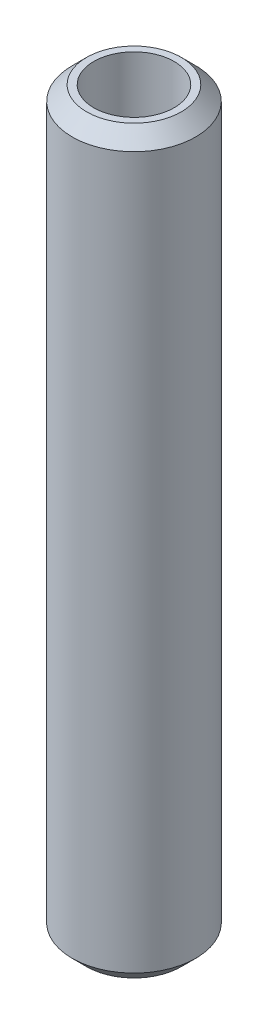
ISO-10303-21;
HEADER;
FILE_DESCRIPTION(('STEP AP214'),'2;1');
FILE_NAME('part.step','',(''),(''),'','','');
FILE_SCHEMA(('AUTOMOTIVE_DESIGN { 1 0 10303 214 1 1 1 1 }'));
ENDSEC;
DATA;
#1=APPLICATION_CONTEXT('core data for automotive mechanical design processes');
#2=APPLICATION_PROTOCOL_DEFINITION('international standard','automotive_design',2000,#1);
#3=PRODUCT_CONTEXT('',#1,'mechanical');
#4=PRODUCT('Part','Part','',(#3));
#5=PRODUCT_RELATED_PRODUCT_CATEGORY('part','',(#4));
#6=PRODUCT_DEFINITION_FORMATION('','',#4);
#7=PRODUCT_DEFINITION_CONTEXT('part definition',#1,'design');
#8=PRODUCT_DEFINITION('design','',#6,#7);
#9=PRODUCT_DEFINITION_SHAPE('','',#8);
#10=(LENGTH_UNIT() NAMED_UNIT(*) SI_UNIT(.MILLI.,.METRE.));
#11=(NAMED_UNIT(*) PLANE_ANGLE_UNIT() SI_UNIT($,.RADIAN.));
#12=(NAMED_UNIT(*) SI_UNIT($,.STERADIAN.) SOLID_ANGLE_UNIT());
#13=UNCERTAINTY_MEASURE_WITH_UNIT(LENGTH_MEASURE(1.E-05),#10,'distance_accuracy_value','');
#14=(GEOMETRIC_REPRESENTATION_CONTEXT(3) GLOBAL_UNCERTAINTY_ASSIGNED_CONTEXT((#13)) GLOBAL_UNIT_ASSIGNED_CONTEXT((#10,
#11,#12)) REPRESENTATION_CONTEXT('',''));
#15=CARTESIAN_POINT('',(0.,0.,0.));
#16=DIRECTION('',(0.,0.,1.));
#17=DIRECTION('',(1.,0.,0.));
#18=AXIS2_PLACEMENT_3D('',#15,#16,#17);
#19=CARTESIAN_POINT('',(0.,89.905274097633,0.));
#20=DIRECTION('',(0.,-1.,0.));
#21=DIRECTION('',(0.,0.,-1.));
#22=AXIS2_PLACEMENT_3D('',#19,#20,#21);
#23=CYLINDRICAL_SURFACE('',#22,7.5);
#24=CARTESIAN_POINT('',(0.,88.1478797142644,0.));
#25=DIRECTION('',(0.,1.,0.));
#26=DIRECTION('',(0.,0.,1.));
#27=AXIS2_PLACEMENT_3D('',#24,#25,#26);
#28=CIRCLE('',#27,7.5);
#29=CARTESIAN_POINT('',(0.,88.1478797142644,7.5));
#30=VERTEX_POINT('',#29);
#31=EDGE_CURVE('E50',#30,#30,#28,.F.);
#32=ORIENTED_EDGE('',*,*,#31,.T.);
#33=EDGE_LOOP('',(#32));
#34=FACE_BOUND('',#33,.T.);
#35=CARTESIAN_POINT('',(0.,1.75739438336855,0.));
#36=DIRECTION('',(0.,1.,0.));
#37=DIRECTION('',(0.,0.,1.));
#38=AXIS2_PLACEMENT_3D('',#35,#36,#37);
#39=CIRCLE('',#38,7.5);
#40=CARTESIAN_POINT('',(0.,1.75739438336855,7.5));
#41=VERTEX_POINT('',#40);
#42=EDGE_CURVE('E51',#41,#41,#39,.T.);
#43=ORIENTED_EDGE('',*,*,#42,.T.);
#44=EDGE_LOOP('',(#43));
#45=FACE_BOUND('',#44,.T.);
#46=ADVANCED_FACE('F39',(#34,#45),#23,.T.);
#47=CARTESIAN_POINT('',(0.,89.905274097633,0.));
#48=DIRECTION('',(0.,1.,0.));
#49=DIRECTION('',(0.,0.,1.));
#50=AXIS2_PLACEMENT_3D('',#47,#48,#49);
#51=PLANE('',#50);
#52=CARTESIAN_POINT('',(0.,89.905274097633,0.));
#53=DIRECTION('',(0.,1.,0.));
#54=DIRECTION('',(0.,0.,1.));
#55=AXIS2_PLACEMENT_3D('',#52,#53,#54);
#56=CIRCLE('',#55,5.74260561663147);
#57=CARTESIAN_POINT('',(0.,89.905274097633,5.74260561663147));
#58=VERTEX_POINT('',#57);
#59=EDGE_CURVE('E54',#58,#58,#56,.T.);
#60=ORIENTED_EDGE('',*,*,#59,.T.);
#61=EDGE_LOOP('',(#60));
#62=FACE_BOUND('',#61,.T.);
#63=CARTESIAN_POINT('',(0.,89.905274097633,0.));
#64=DIRECTION('',(0.,1.,0.));
#65=DIRECTION('',(0.,0.,1.));
#66=AXIS2_PLACEMENT_3D('',#63,#64,#65);
#67=CIRCLE('',#66,4.87910478652996);
#68=CARTESIAN_POINT('',(0.,89.905274097633,4.87910478652996));
#69=VERTEX_POINT('',#68);
#70=EDGE_CURVE('E58',#69,#69,#67,.T.);
#71=ORIENTED_EDGE('',*,*,#70,.F.);
#72=EDGE_LOOP('',(#71));
#73=FACE_BOUND('',#72,.T.);
#74=ADVANCED_FACE('F69',(#62,#73),#51,.T.);
#75=CARTESIAN_POINT('',(0.,0.,0.));
#76=DIRECTION('',(0.,1.,0.));
#77=DIRECTION('',(0.,0.,1.));
#78=AXIS2_PLACEMENT_3D('',#75,#76,#77);
#79=PLANE('',#78);
#80=CARTESIAN_POINT('',(0.,0.,0.));
#81=DIRECTION('',(0.,1.,0.));
#82=DIRECTION('',(0.,0.,1.));
#83=AXIS2_PLACEMENT_3D('',#80,#81,#82);
#84=CIRCLE('',#83,5.74260561663144);
#85=CARTESIAN_POINT('',(0.,0.,5.74260561663144));
#86=VERTEX_POINT('',#85);
#87=EDGE_CURVE('E10',#86,#86,#84,.F.);
#88=ORIENTED_EDGE('',*,*,#87,.T.);
#89=EDGE_LOOP('',(#88));
#90=FACE_BOUND('',#89,.T.);
#91=CARTESIAN_POINT('',(0.,0.,0.));
#92=DIRECTION('',(0.,1.,0.));
#93=DIRECTION('',(0.,0.,1.));
#94=AXIS2_PLACEMENT_3D('',#91,#92,#93);
#95=CIRCLE('',#94,4.87910478652996);
#96=CARTESIAN_POINT('',(0.,0.,4.87910478652996));
#97=VERTEX_POINT('',#96);
#98=EDGE_CURVE('E63',#97,#97,#95,.T.);
#99=ORIENTED_EDGE('',*,*,#98,.T.);
#100=EDGE_LOOP('',(#99));
#101=FACE_BOUND('',#100,.T.);
#102=ADVANCED_FACE('F75',(#90,#101),#79,.F.);
#103=CARTESIAN_POINT('',(0.,89.905274097633,0.));
#104=DIRECTION('',(0.,-1.,0.));
#105=DIRECTION('',(0.,0.,-1.));
#106=AXIS2_PLACEMENT_3D('',#103,#104,#105);
#107=CYLINDRICAL_SURFACE('',#106,4.87910478652996);
#108=ORIENTED_EDGE('',*,*,#70,.T.);
#109=EDGE_LOOP('',(#108));
#110=FACE_BOUND('',#109,.T.);
#111=ORIENTED_EDGE('',*,*,#98,.F.);
#112=EDGE_LOOP('',(#111));
#113=FACE_BOUND('',#112,.T.);
#114=ADVANCED_FACE('F70',(#110,#113),#107,.F.);
#115=CARTESIAN_POINT('',(0.,89.905274097633,0.));
#116=DIRECTION('',(0.,-1.,0.));
#117=DIRECTION('',(0.,0.,-1.));
#118=AXIS2_PLACEMENT_3D('',#115,#116,#117);
#119=CONICAL_SURFACE('',#118,5.74260561663147,0.785398163397446);
#120=ORIENTED_EDGE('',*,*,#31,.F.);
#121=EDGE_LOOP('',(#120));
#122=FACE_BOUND('',#121,.T.);
#123=ORIENTED_EDGE('',*,*,#59,.F.);
#124=EDGE_LOOP('',(#123));
#125=FACE_BOUND('',#124,.T.);
#126=ADVANCED_FACE('F81',(#122,#125),#119,.T.);
#127=CARTESIAN_POINT('',(0.,1.75739438336855,0.));
#128=DIRECTION('',(0.,1.,0.));
#129=DIRECTION('',(0.,0.,1.));
#130=AXIS2_PLACEMENT_3D('',#127,#128,#129);
#131=CONICAL_SURFACE('',#130,7.5,0.785398163397448);
#132=CARTESIAN_POINT('',(0.,0.,5.74260561663144));
#133=CARTESIAN_POINT('',(0.,0.0183061914934227,5.76091180812487));
#134=CARTESIAN_POINT('',(0.,0.036612382986845,5.77921799961829));
#135=CARTESIAN_POINT('',(0.,0.0732247659736895,5.81583038260513));
#136=CARTESIAN_POINT('',(0.,0.0915309574671118,5.83413657409856));
#137=CARTESIAN_POINT('',(0.,0.128143340453957,5.8707489570854));
#138=CARTESIAN_POINT('',(0.,0.146449531947379,5.88905514857882));
#139=CARTESIAN_POINT('',(0.,0.183061914934224,5.92566753156567));
#140=CARTESIAN_POINT('',(0.,0.201368106427647,5.94397372305909));
#141=CARTESIAN_POINT('',(0.,0.237980489414491,5.98058610604594));
#142=CARTESIAN_POINT('',(0.,0.256286680907914,5.99889229753936));
#143=CARTESIAN_POINT('',(0.,0.292899063894759,6.0355046805262));
#144=CARTESIAN_POINT('',(0.,0.311205255388181,6.05381087201963));
#145=CARTESIAN_POINT('',(0.,0.347817638375026,6.09042325500647));
#146=CARTESIAN_POINT('',(0.,0.366123829868449,6.10872944649989));
#147=CARTESIAN_POINT('',(0.,0.402736212855294,6.14534182948674));
#148=CARTESIAN_POINT('',(0.,0.421042404348716,6.16364802098016));
#149=CARTESIAN_POINT('',(0.,0.457654787335561,6.20026040396701));
#150=CARTESIAN_POINT('',(0.,0.475960978828983,6.21856659546043));
#151=CARTESIAN_POINT('',(0.,0.512573361815828,6.25517897844727));
#152=CARTESIAN_POINT('',(0.,0.530879553309251,6.2734851699407));
#153=CARTESIAN_POINT('',(0.,0.567491936296095,6.31009755292754));
#154=CARTESIAN_POINT('',(0.,0.585798127789518,6.32840374442096));
#155=CARTESIAN_POINT('',(0.,0.622410510776363,6.36501612740781));
#156=CARTESIAN_POINT('',(0.,0.640716702269785,6.38332231890123));
#157=CARTESIAN_POINT('',(0.,0.67732908525663,6.41993470188808));
#158=CARTESIAN_POINT('',(0.,0.695635276750053,6.4382408933815));
#159=CARTESIAN_POINT('',(0.,0.732247659736898,6.47485327636834));
#160=CARTESIAN_POINT('',(0.,0.75055385123032,6.49315946786176));
#161=CARTESIAN_POINT('',(0.,0.787166234217165,6.52977185084861));
#162=CARTESIAN_POINT('',(0.,0.805472425710587,6.54807804234203));
#163=CARTESIAN_POINT('',(0.,0.842084808697432,6.58469042532888));
#164=CARTESIAN_POINT('',(0.,0.860391000190855,6.6029966168223));
#165=CARTESIAN_POINT('',(0.,0.897003383177699,6.63960899980914));
#166=CARTESIAN_POINT('',(0.,0.915309574671122,6.65791519130257));
#167=CARTESIAN_POINT('',(0.,0.951921957657967,6.69452757428941));
#168=CARTESIAN_POINT('',(0.,0.970228149151389,6.71283376578283));
#169=CARTESIAN_POINT('',(0.,1.00684053213823,6.74944614876968));
#170=CARTESIAN_POINT('',(0.,1.02514672363166,6.7677523402631));
#171=CARTESIAN_POINT('',(0.,1.0617591066185,6.80436472324995));
#172=CARTESIAN_POINT('',(0.,1.08006529811192,6.82267091474337));
#173=CARTESIAN_POINT('',(0.,1.11667768109877,6.85928329773021));
#174=CARTESIAN_POINT('',(0.,1.13498387259219,6.87758948922364));
#175=CARTESIAN_POINT('',(0.,1.17159625557904,6.91420187221048));
#176=CARTESIAN_POINT('',(0.,1.18990244707246,6.9325080637039));
#177=CARTESIAN_POINT('',(0.,1.2265148300593,6.96912044669075));
#178=CARTESIAN_POINT('',(0.,1.24482102155273,6.98742663818417));
#179=CARTESIAN_POINT('',(0.,1.28143340453957,7.02403902117102));
#180=CARTESIAN_POINT('',(0.,1.29973959603299,7.04234521266444));
#181=CARTESIAN_POINT('',(0.,1.33635197901984,7.07895759565128));
#182=CARTESIAN_POINT('',(0.,1.35465817051326,7.09726378714471));
#183=CARTESIAN_POINT('',(0.,1.39127055350011,7.13387617013155));
#184=CARTESIAN_POINT('',(0.,1.40957674499353,7.15218236162497));
#185=CARTESIAN_POINT('',(0.,1.44618912798037,7.18879474461182));
#186=CARTESIAN_POINT('',(0.,1.4644953194738,7.20710093610524));
#187=CARTESIAN_POINT('',(0.,1.50110770246064,7.24371331909209));
#188=CARTESIAN_POINT('',(0.,1.51941389395406,7.26201951058551));
#189=CARTESIAN_POINT('',(0.,1.55602627694091,7.29863189357235));
#190=CARTESIAN_POINT('',(0.,1.57433246843433,7.31693808506578));
#191=CARTESIAN_POINT('',(0.,1.61094485142117,7.35355046805262));
#192=CARTESIAN_POINT('',(0.,1.6292510429146,7.37185665954604));
#193=CARTESIAN_POINT('',(0.,1.66586342590144,7.40846904253289));
#194=CARTESIAN_POINT('',(0.,1.68416961739486,7.42677523402631));
#195=CARTESIAN_POINT('',(0.,1.72078200038171,7.46338761701316));
#196=CARTESIAN_POINT('',(0.,1.73908819187513,7.48169380850658));
#197=CARTESIAN_POINT('',(0.,1.75739438336855,7.5));
#198=B_SPLINE_CURVE_WITH_KNOTS('',3,(#132,#133,#134,#135,#136,#137,#138,#139,#140,#141,#142,
#143,#144,#145,#146,#147,#148,#149,#150,#151,#152,#153,#154,#155,#156,#157,#158,#159,#160,#161,
#162,#163,#164,#165,#166,#167,#168,#169,#170,#171,#172,#173,#174,#175,#176,#177,#178,#179,#180,
#181,#182,#183,#184,#185,#186,#187,#188,#189,#190,#191,#192,#193,#194,#195,#196,#197),
.UNSPECIFIED.,.F.,.F.,(4,2,2,2,2,2,2,2,2,2,2,2,2,2,2,2,2,2,2,2,2,2,2,2,2,2,2,2,2,2,2,2,4),(0.,
0.0776665928561904,0.155333185712382,0.232999778568572,0.310666371424764,0.388332964280954,
0.465999557137146,0.543666149993336,0.621332742849528,0.698999335705718,0.77666592856191,
0.8543325214181,0.931999114274292,1.00966570713048,1.08733229998667,1.16499889284287,
1.24266548569906,1.32033207855525,1.39799867141144,1.47566526426763,1.55333185712382,
1.63099844998001,1.7086650428362,1.78633163569239,1.86399822854858,1.94166482140477,
2.01933141426097,2.09699800711716,2.17466459997335,2.25233119282954,2.32999778568573,
2.40766437854192,2.48533097139811),.UNSPECIFIED.);
#199=EDGE_CURVE('BSEAM45',#86,#41,#198,.T.);
#200=ORIENTED_EDGE('',*,*,#87,.F.);
#201=ORIENTED_EDGE('',*,*,#42,.F.);
#202=ORIENTED_EDGE('',*,*,#199,.T.);
#203=ORIENTED_EDGE('',*,*,#199,.F.);
#204=EDGE_LOOP('',(#200,#202,#201,#203));
#205=FACE_BOUND('',#204,.T.);
#206=ADVANCED_FACE('F45',(#205),#131,.T.);
#207=CLOSED_SHELL('',(#46,#74,#102,#114,#126,#206));
#208=MANIFOLD_SOLID_BREP('B2',#207);
#209=ADVANCED_BREP_SHAPE_REPRESENTATION('',(#18,#208),#14);
#210=SHAPE_DEFINITION_REPRESENTATION(#9,#209);
ENDSEC;
END-ISO-10303-21;
